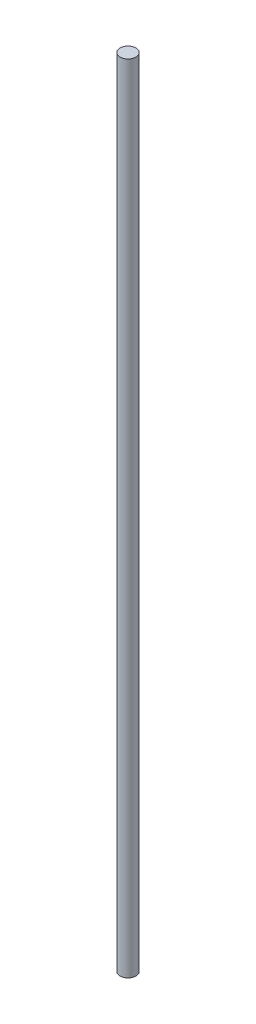
ISO-10303-21;
HEADER;
FILE_DESCRIPTION(('STEP AP214'),'2;1');
FILE_NAME('part.step','',(''),(''),'','','');
FILE_SCHEMA(('AUTOMOTIVE_DESIGN { 1 0 10303 214 1 1 1 1 }'));
ENDSEC;
DATA;
#1=APPLICATION_CONTEXT('core data for automotive mechanical design processes');
#2=APPLICATION_PROTOCOL_DEFINITION('international standard','automotive_design',2000,#1);
#3=PRODUCT_CONTEXT('',#1,'mechanical');
#4=PRODUCT('Part','Part','',(#3));
#5=PRODUCT_RELATED_PRODUCT_CATEGORY('part','',(#4));
#6=PRODUCT_DEFINITION_FORMATION('','',#4);
#7=PRODUCT_DEFINITION_CONTEXT('part definition',#1,'design');
#8=PRODUCT_DEFINITION('design','',#6,#7);
#9=PRODUCT_DEFINITION_SHAPE('','',#8);
#10=(LENGTH_UNIT() NAMED_UNIT(*) SI_UNIT(.MILLI.,.METRE.));
#11=(NAMED_UNIT(*) PLANE_ANGLE_UNIT() SI_UNIT($,.RADIAN.));
#12=(NAMED_UNIT(*) SI_UNIT($,.STERADIAN.) SOLID_ANGLE_UNIT());
#13=UNCERTAINTY_MEASURE_WITH_UNIT(LENGTH_MEASURE(1.E-05),#10,'distance_accuracy_value','');
#14=(GEOMETRIC_REPRESENTATION_CONTEXT(3) GLOBAL_UNCERTAINTY_ASSIGNED_CONTEXT((#13)) GLOBAL_UNIT_ASSIGNED_CONTEXT((#10,
#11,#12)) REPRESENTATION_CONTEXT('',''));
#15=CARTESIAN_POINT('',(0.,0.,0.));
#16=DIRECTION('',(0.,0.,1.));
#17=DIRECTION('',(1.,0.,0.));
#18=AXIS2_PLACEMENT_3D('',#15,#16,#17);
#19=CARTESIAN_POINT('',(-18.4439631121106,400.,-5.19398961203114));
#20=DIRECTION('',(0.,-1.,0.));
#21=DIRECTION('',(0.,0.,-1.));
#22=AXIS2_PLACEMENT_3D('',#19,#20,#21);
#23=CYLINDRICAL_SURFACE('',#22,4.);
#24=CARTESIAN_POINT('',(-18.4439631121106,400.,-5.19398961203114));
#25=DIRECTION('',(0.,1.,0.));
#26=DIRECTION('',(0.,0.,1.));
#27=AXIS2_PLACEMENT_3D('',#24,#25,#26);
#28=CIRCLE('',#27,4.);
#29=CARTESIAN_POINT('',(-18.4439631121106,400.,-1.19398961203114));
#30=VERTEX_POINT('',#29);
#31=EDGE_CURVE('E10',#30,#30,#28,.T.);
#32=ORIENTED_EDGE('',*,*,#31,.F.);
#33=EDGE_LOOP('',(#32));
#34=FACE_BOUND('',#33,.T.);
#35=CARTESIAN_POINT('',(-18.4439631121106,0.,-5.19398961203114));
#36=DIRECTION('',(0.,1.,0.));
#37=DIRECTION('',(0.,0.,1.));
#38=AXIS2_PLACEMENT_3D('',#35,#36,#37);
#39=CIRCLE('',#38,4.);
#40=CARTESIAN_POINT('',(-18.4439631121106,0.,-1.19398961203114));
#41=VERTEX_POINT('',#40);
#42=EDGE_CURVE('E33',#41,#41,#39,.T.);
#43=ORIENTED_EDGE('',*,*,#42,.T.);
#44=EDGE_LOOP('',(#43));
#45=FACE_BOUND('',#44,.T.);
#46=ADVANCED_FACE('F30',(#34,#45),#23,.T.);
#47=CARTESIAN_POINT('',(-18.4439631121106,400.,-5.19398961203114));
#48=DIRECTION('',(0.,1.,0.));
#49=DIRECTION('',(0.,0.,1.));
#50=AXIS2_PLACEMENT_3D('',#47,#48,#49);
#51=PLANE('',#50);
#52=ORIENTED_EDGE('',*,*,#31,.T.);
#53=EDGE_LOOP('',(#52));
#54=FACE_BOUND('',#53,.T.);
#55=ADVANCED_FACE('F45',(#54),#51,.T.);
#56=CARTESIAN_POINT('',(-18.4439631121106,0.,-5.19398961203114));
#57=DIRECTION('',(0.,1.,0.));
#58=DIRECTION('',(0.,0.,1.));
#59=AXIS2_PLACEMENT_3D('',#56,#57,#58);
#60=PLANE('',#59);
#61=ORIENTED_EDGE('',*,*,#42,.F.);
#62=EDGE_LOOP('',(#61));
#63=FACE_BOUND('',#62,.T.);
#64=ADVANCED_FACE('F43',(#63),#60,.F.);
#65=CLOSED_SHELL('',(#46,#55,#64));
#66=MANIFOLD_SOLID_BREP('B2',#65);
#67=ADVANCED_BREP_SHAPE_REPRESENTATION('',(#18,#66),#14);
#68=SHAPE_DEFINITION_REPRESENTATION(#9,#67);
ENDSEC;
END-ISO-10303-21;
